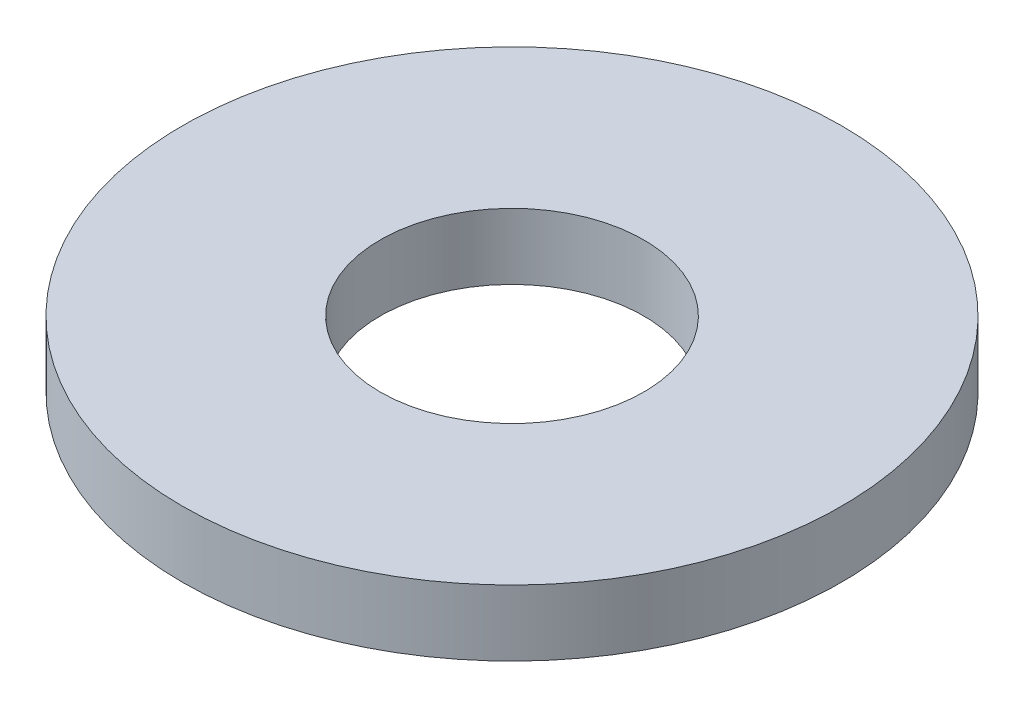
ISO-10303-21;
HEADER;
FILE_DESCRIPTION(('STEP AP214'),'2;1');
FILE_NAME('part.step','',(''),(''),'','','');
FILE_SCHEMA(('AUTOMOTIVE_DESIGN { 1 0 10303 214 1 1 1 1 }'));
ENDSEC;
DATA;
#1=APPLICATION_CONTEXT('core data for automotive mechanical design processes');
#2=APPLICATION_PROTOCOL_DEFINITION('international standard','automotive_design',2000,#1);
#3=PRODUCT_CONTEXT('',#1,'mechanical');
#4=PRODUCT('Part','Part','',(#3));
#5=PRODUCT_RELATED_PRODUCT_CATEGORY('part','',(#4));
#6=PRODUCT_DEFINITION_FORMATION('','',#4);
#7=PRODUCT_DEFINITION_CONTEXT('part definition',#1,'design');
#8=PRODUCT_DEFINITION('design','',#6,#7);
#9=PRODUCT_DEFINITION_SHAPE('','',#8);
#10=(LENGTH_UNIT() NAMED_UNIT(*) SI_UNIT(.MILLI.,.METRE.));
#11=(NAMED_UNIT(*) PLANE_ANGLE_UNIT() SI_UNIT($,.RADIAN.));
#12=(NAMED_UNIT(*) SI_UNIT($,.STERADIAN.) SOLID_ANGLE_UNIT());
#13=UNCERTAINTY_MEASURE_WITH_UNIT(LENGTH_MEASURE(1.E-05),#10,'distance_accuracy_value','');
#14=(GEOMETRIC_REPRESENTATION_CONTEXT(3) GLOBAL_UNCERTAINTY_ASSIGNED_CONTEXT((#13)) GLOBAL_UNIT_ASSIGNED_CONTEXT((#10,
#11,#12)) REPRESENTATION_CONTEXT('',''));
#15=CARTESIAN_POINT('',(0.,0.,0.));
#16=DIRECTION('',(0.,0.,1.));
#17=DIRECTION('',(1.,0.,0.));
#18=AXIS2_PLACEMENT_3D('',#15,#16,#17);
#19=CARTESIAN_POINT('',(0.,1.5875,0.));
#20=DIRECTION('',(0.,1.,0.));
#21=DIRECTION('',(0.,0.,1.));
#22=AXIS2_PLACEMENT_3D('',#19,#20,#21);
#23=PLANE('',#22);
#24=CARTESIAN_POINT('',(0.,1.5875,0.));
#25=DIRECTION('',(0.,1.,0.));
#26=DIRECTION('',(0.,0.,1.));
#27=AXIS2_PLACEMENT_3D('',#24,#25,#26);
#28=CIRCLE('',#27,7.9375);
#29=CARTESIAN_POINT('',(0.,1.5875,7.9375));
#30=VERTEX_POINT('',#29);
#31=EDGE_CURVE('E10',#30,#30,#28,.T.);
#32=ORIENTED_EDGE('',*,*,#31,.T.);
#33=EDGE_LOOP('',(#32));
#34=FACE_BOUND('',#33,.T.);
#35=CARTESIAN_POINT('',(0.,1.5875,0.));
#36=DIRECTION('',(0.,1.,0.));
#37=DIRECTION('',(0.,0.,1.));
#38=AXIS2_PLACEMENT_3D('',#35,#36,#37);
#39=CIRCLE('',#38,3.175);
#40=CARTESIAN_POINT('',(0.,1.5875,3.175));
#41=VERTEX_POINT('',#40);
#42=EDGE_CURVE('E45',#41,#41,#39,.T.);
#43=ORIENTED_EDGE('',*,*,#42,.F.);
#44=EDGE_LOOP('',(#43));
#45=FACE_BOUND('',#44,.T.);
#46=ADVANCED_FACE('F34',(#34,#45),#23,.T.);
#47=CARTESIAN_POINT('',(0.,0.,0.));
#48=DIRECTION('',(0.,1.,0.));
#49=DIRECTION('',(0.,0.,1.));
#50=AXIS2_PLACEMENT_3D('',#47,#48,#49);
#51=PLANE('',#50);
#52=CARTESIAN_POINT('',(0.,0.,0.));
#53=DIRECTION('',(0.,1.,0.));
#54=DIRECTION('',(0.,0.,1.));
#55=AXIS2_PLACEMENT_3D('',#52,#53,#54);
#56=CIRCLE('',#55,7.9375);
#57=CARTESIAN_POINT('',(0.,0.,7.9375));
#58=VERTEX_POINT('',#57);
#59=EDGE_CURVE('E38',#58,#58,#56,.T.);
#60=ORIENTED_EDGE('',*,*,#59,.F.);
#61=EDGE_LOOP('',(#60));
#62=FACE_BOUND('',#61,.T.);
#63=CARTESIAN_POINT('',(0.,0.,0.));
#64=DIRECTION('',(0.,1.,0.));
#65=DIRECTION('',(0.,0.,1.));
#66=AXIS2_PLACEMENT_3D('',#63,#64,#65);
#67=CIRCLE('',#66,3.175);
#68=CARTESIAN_POINT('',(0.,0.,3.175));
#69=VERTEX_POINT('',#68);
#70=EDGE_CURVE('E47',#69,#69,#67,.T.);
#71=ORIENTED_EDGE('',*,*,#70,.T.);
#72=EDGE_LOOP('',(#71));
#73=FACE_BOUND('',#72,.T.);
#74=ADVANCED_FACE('F57',(#62,#73),#51,.F.);
#75=CARTESIAN_POINT('',(0.,1.5875,0.));
#76=DIRECTION('',(0.,-1.,0.));
#77=DIRECTION('',(0.,0.,-1.));
#78=AXIS2_PLACEMENT_3D('',#75,#76,#77);
#79=CYLINDRICAL_SURFACE('',#78,7.9375);
#80=ORIENTED_EDGE('',*,*,#31,.F.);
#81=EDGE_LOOP('',(#80));
#82=FACE_BOUND('',#81,.T.);
#83=ORIENTED_EDGE('',*,*,#59,.T.);
#84=EDGE_LOOP('',(#83));
#85=FACE_BOUND('',#84,.T.);
#86=ADVANCED_FACE('F36',(#82,#85),#79,.T.);
#87=CARTESIAN_POINT('',(0.,1.5875,0.));
#88=DIRECTION('',(0.,-1.,0.));
#89=DIRECTION('',(0.,0.,-1.));
#90=AXIS2_PLACEMENT_3D('',#87,#88,#89);
#91=CYLINDRICAL_SURFACE('',#90,3.175);
#92=ORIENTED_EDGE('',*,*,#42,.T.);
#93=EDGE_LOOP('',(#92));
#94=FACE_BOUND('',#93,.T.);
#95=ORIENTED_EDGE('',*,*,#70,.F.);
#96=EDGE_LOOP('',(#95));
#97=FACE_BOUND('',#96,.T.);
#98=ADVANCED_FACE('F53',(#94,#97),#91,.F.);
#99=CLOSED_SHELL('',(#46,#74,#86,#98));
#100=MANIFOLD_SOLID_BREP('B2',#99);
#101=ADVANCED_BREP_SHAPE_REPRESENTATION('',(#18,#100),#14);
#102=SHAPE_DEFINITION_REPRESENTATION(#9,#101);
ENDSEC;
END-ISO-10303-21;
